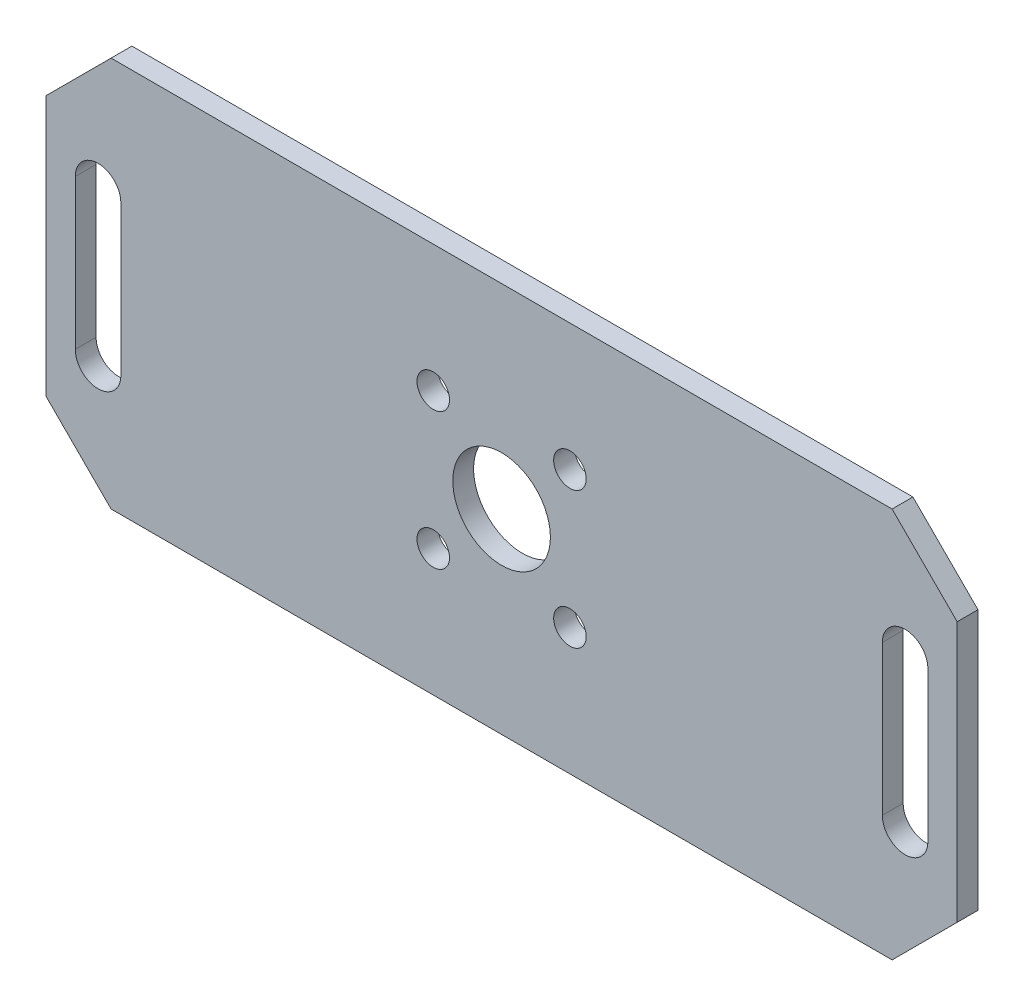
ISO-10303-21;
HEADER;
FILE_DESCRIPTION(('STEP AP214'),'2;1');
FILE_NAME('part.step','',(''),(''),'','','');
FILE_SCHEMA(('AUTOMOTIVE_DESIGN { 1 0 10303 214 1 1 1 1 }'));
ENDSEC;
DATA;
#1=APPLICATION_CONTEXT('core data for automotive mechanical design processes');
#2=APPLICATION_PROTOCOL_DEFINITION('international standard','automotive_design',2000,#1);
#3=PRODUCT_CONTEXT('',#1,'mechanical');
#4=PRODUCT('Part','Part','',(#3));
#5=PRODUCT_RELATED_PRODUCT_CATEGORY('part','',(#4));
#6=PRODUCT_DEFINITION_FORMATION('','',#4);
#7=PRODUCT_DEFINITION_CONTEXT('part definition',#1,'design');
#8=PRODUCT_DEFINITION('design','',#6,#7);
#9=PRODUCT_DEFINITION_SHAPE('','',#8);
#10=(LENGTH_UNIT() NAMED_UNIT(*) SI_UNIT(.MILLI.,.METRE.));
#11=(NAMED_UNIT(*) PLANE_ANGLE_UNIT() SI_UNIT($,.RADIAN.));
#12=(NAMED_UNIT(*) SI_UNIT($,.STERADIAN.) SOLID_ANGLE_UNIT());
#13=UNCERTAINTY_MEASURE_WITH_UNIT(LENGTH_MEASURE(1.E-05),#10,'distance_accuracy_value','');
#14=(GEOMETRIC_REPRESENTATION_CONTEXT(3) GLOBAL_UNCERTAINTY_ASSIGNED_CONTEXT((#13)) GLOBAL_UNIT_ASSIGNED_CONTEXT((#10,
#11,#12)) REPRESENTATION_CONTEXT('',''));
#15=CARTESIAN_POINT('',(0.,0.,0.));
#16=DIRECTION('',(0.,0.,1.));
#17=DIRECTION('',(1.,0.,0.));
#18=AXIS2_PLACEMENT_3D('',#15,#16,#17);
#19=CARTESIAN_POINT('',(0.,0.,3.2));
#20=DIRECTION('',(0.,0.,-1.));
#21=DIRECTION('',(-1.,0.,0.));
#22=AXIS2_PLACEMENT_3D('',#19,#20,#21);
#23=PLANE('',#22);
#24=CARTESIAN_POINT('',(10.5,-10.5,3.2));
#25=DIRECTION('',(0.,0.,1.));
#26=DIRECTION('',(1.,0.,0.));
#27=AXIS2_PLACEMENT_3D('',#24,#25,#26);
#28=CIRCLE('',#27,2.5);
#29=CARTESIAN_POINT('',(13.,-10.5,3.2));
#30=VERTEX_POINT('',#29);
#31=EDGE_CURVE('E530',#30,#30,#28,.T.);
#32=ORIENTED_EDGE('',*,*,#31,.F.);
#33=EDGE_LOOP('',(#32));
#34=FACE_BOUND('',#33,.T.);
#35=CARTESIAN_POINT('',(-10.5,10.5,3.2));
#36=DIRECTION('',(0.,0.,1.));
#37=DIRECTION('',(1.,0.,0.));
#38=AXIS2_PLACEMENT_3D('',#35,#36,#37);
#39=CIRCLE('',#38,2.5);
#40=CARTESIAN_POINT('',(-8.,10.5,3.2));
#41=VERTEX_POINT('',#40);
#42=EDGE_CURVE('E542',#41,#41,#39,.T.);
#43=ORIENTED_EDGE('',*,*,#42,.F.);
#44=EDGE_LOOP('',(#43));
#45=FACE_BOUND('',#44,.T.);
#46=CARTESIAN_POINT('',(62.,-11.5,3.2));
#47=DIRECTION('',(0.,0.,1.));
#48=DIRECTION('',(1.,0.,0.));
#49=AXIS2_PLACEMENT_3D('',#46,#47,#48);
#50=CIRCLE('',#49,3.5);
#51=CARTESIAN_POINT('',(58.5,-11.5,3.2));
#52=VERTEX_POINT('',#51);
#53=CARTESIAN_POINT('',(65.5,-11.5,3.2));
#54=VERTEX_POINT('',#53);
#55=EDGE_CURVE('E152',#52,#54,#50,.T.);
#56=ORIENTED_EDGE('',*,*,#55,.F.);
#57=DIRECTION('',(0.,-1.,0.));
#58=VECTOR('',#57,1.);
#59=CARTESIAN_POINT('',(58.5,-11.5,3.2));
#60=LINE('',#59,#58);
#61=CARTESIAN_POINT('',(58.5,11.5,3.2));
#62=VERTEX_POINT('',#61);
#63=EDGE_CURVE('E177',#62,#52,#60,.T.);
#64=ORIENTED_EDGE('',*,*,#63,.F.);
#65=CARTESIAN_POINT('',(62.,11.5,3.2));
#66=DIRECTION('',(0.,0.,1.));
#67=DIRECTION('',(1.,0.,0.));
#68=AXIS2_PLACEMENT_3D('',#65,#66,#67);
#69=CIRCLE('',#68,3.5);
#70=CARTESIAN_POINT('',(65.5,11.5,3.2));
#71=VERTEX_POINT('',#70);
#72=EDGE_CURVE('E175',#71,#62,#69,.T.);
#73=ORIENTED_EDGE('',*,*,#72,.F.);
#74=DIRECTION('',(0.,1.,0.));
#75=VECTOR('',#74,1.);
#76=CARTESIAN_POINT('',(65.5,-11.5,3.2));
#77=LINE('',#76,#75);
#78=EDGE_CURVE('E162',#54,#71,#77,.T.);
#79=ORIENTED_EDGE('',*,*,#78,.F.);
#80=EDGE_LOOP('',(#56,#64,#73,#79));
#81=FACE_BOUND('',#80,.T.);
#82=DIRECTION('',(0.,-1.,0.));
#83=VECTOR('',#82,1.);
#84=CARTESIAN_POINT('',(-70.,-30.,3.2));
#85=LINE('',#84,#83);
#86=CARTESIAN_POINT('',(-70.,20.,3.2));
#87=VERTEX_POINT('',#86);
#88=CARTESIAN_POINT('',(-70.,-20.,3.2));
#89=VERTEX_POINT('',#88);
#90=EDGE_CURVE('E231',#87,#89,#85,.T.);
#91=ORIENTED_EDGE('',*,*,#90,.T.);
#92=DIRECTION('',(-0.707106781186546,0.70710678118655,0.));
#93=VECTOR('',#92,1.);
#94=CARTESIAN_POINT('',(-60.0000000000001,-30.,3.2));
#95=LINE('',#94,#93);
#96=CARTESIAN_POINT('',(-60.0000000000001,-30.,3.2));
#97=VERTEX_POINT('',#96);
#98=EDGE_CURVE('E269',#89,#97,#95,.F.);
#99=ORIENTED_EDGE('',*,*,#98,.T.);
#100=DIRECTION('',(1.,0.,0.));
#101=VECTOR('',#100,1.);
#102=CARTESIAN_POINT('',(-70.,-30.,3.2));
#103=LINE('',#102,#101);
#104=CARTESIAN_POINT('',(60.,-30.,3.2));
#105=VERTEX_POINT('',#104);
#106=EDGE_CURVE('E234',#97,#105,#103,.T.);
#107=ORIENTED_EDGE('',*,*,#106,.T.);
#108=DIRECTION('',(-0.707106781186549,-0.707106781186546,0.));
#109=VECTOR('',#108,1.);
#110=CARTESIAN_POINT('',(70.,-20.,3.2));
#111=LINE('',#110,#109);
#112=CARTESIAN_POINT('',(70.,-20.,3.2));
#113=VERTEX_POINT('',#112);
#114=EDGE_CURVE('E267',#105,#113,#111,.F.);
#115=ORIENTED_EDGE('',*,*,#114,.T.);
#116=DIRECTION('',(0.,1.,0.));
#117=VECTOR('',#116,1.);
#118=CARTESIAN_POINT('',(70.,-30.,3.2));
#119=LINE('',#118,#117);
#120=CARTESIAN_POINT('',(70.,20.,3.2));
#121=VERTEX_POINT('',#120);
#122=EDGE_CURVE('E226',#113,#121,#119,.T.);
#123=ORIENTED_EDGE('',*,*,#122,.T.);
#124=DIRECTION('',(0.707106781186546,-0.70710678118655,0.));
#125=VECTOR('',#124,1.);
#126=CARTESIAN_POINT('',(60.,30.,3.2));
#127=LINE('',#126,#125);
#128=CARTESIAN_POINT('',(60.,30.,3.2));
#129=VERTEX_POINT('',#128);
#130=EDGE_CURVE('E58',#121,#129,#127,.F.);
#131=ORIENTED_EDGE('',*,*,#130,.T.);
#132=DIRECTION('',(-1.,0.,0.));
#133=VECTOR('',#132,1.);
#134=CARTESIAN_POINT('',(-70.,30.,3.2));
#135=LINE('',#134,#133);
#136=CARTESIAN_POINT('',(-60.,30.,3.2));
#137=VERTEX_POINT('',#136);
#138=EDGE_CURVE('E228',#129,#137,#135,.T.);
#139=ORIENTED_EDGE('',*,*,#138,.T.);
#140=DIRECTION('',(0.707106781186549,0.707106781186546,0.));
#141=VECTOR('',#140,1.);
#142=CARTESIAN_POINT('',(-70.,20.,3.2));
#143=LINE('',#142,#141);
#144=EDGE_CURVE('E264',#137,#87,#143,.F.);
#145=ORIENTED_EDGE('',*,*,#144,.T.);
#146=EDGE_LOOP('',(#91,#99,#107,#115,#123,#131,#139,#145));
#147=FACE_BOUND('',#146,.T.);
#148=CARTESIAN_POINT('',(-62.,-11.4999999999999,3.2));
#149=DIRECTION('',(0.,0.,1.));
#150=DIRECTION('',(1.,0.,0.));
#151=AXIS2_PLACEMENT_3D('',#148,#149,#150);
#152=CIRCLE('',#151,3.5);
#153=CARTESIAN_POINT('',(-65.5,-11.4999999999999,3.2));
#154=VERTEX_POINT('',#153);
#155=CARTESIAN_POINT('',(-58.5,-11.4999999999999,3.2));
#156=VERTEX_POINT('',#155);
#157=EDGE_CURVE('E195',#154,#156,#152,.T.);
#158=ORIENTED_EDGE('',*,*,#157,.F.);
#159=DIRECTION('',(0.,-1.,0.));
#160=VECTOR('',#159,1.);
#161=CARTESIAN_POINT('',(-65.5,-11.4999999999999,3.2));
#162=LINE('',#161,#160);
#163=CARTESIAN_POINT('',(-65.5,11.4999999999999,3.2));
#164=VERTEX_POINT('',#163);
#165=EDGE_CURVE('E203',#164,#154,#162,.T.);
#166=ORIENTED_EDGE('',*,*,#165,.F.);
#167=CARTESIAN_POINT('',(-62.,11.4999999999999,3.2));
#168=DIRECTION('',(0.,0.,1.));
#169=DIRECTION('',(1.,0.,0.));
#170=AXIS2_PLACEMENT_3D('',#167,#168,#169);
#171=CIRCLE('',#170,3.5);
#172=CARTESIAN_POINT('',(-58.5,11.5000000000001,3.2));
#173=VERTEX_POINT('',#172);
#174=EDGE_CURVE('E200',#173,#164,#171,.T.);
#175=ORIENTED_EDGE('',*,*,#174,.F.);
#176=DIRECTION('',(0.,1.,0.));
#177=VECTOR('',#176,1.);
#178=CARTESIAN_POINT('',(-58.5,-11.4999999999999,3.2));
#179=LINE('',#178,#177);
#180=EDGE_CURVE('E197',#156,#173,#179,.T.);
#181=ORIENTED_EDGE('',*,*,#180,.F.);
#182=EDGE_LOOP('',(#158,#166,#175,#181));
#183=FACE_BOUND('',#182,.T.);
#184=CARTESIAN_POINT('',(0.,0.,3.2));
#185=DIRECTION('',(0.,0.,1.));
#186=DIRECTION('',(1.,0.,0.));
#187=AXIS2_PLACEMENT_3D('',#184,#185,#186);
#188=CIRCLE('',#187,7.5);
#189=CARTESIAN_POINT('',(7.49999999999998,0.,3.2));
#190=VERTEX_POINT('',#189);
#191=EDGE_CURVE('E184',#190,#190,#188,.T.);
#192=ORIENTED_EDGE('',*,*,#191,.F.);
#193=EDGE_LOOP('',(#192));
#194=FACE_BOUND('',#193,.T.);
#195=CARTESIAN_POINT('',(10.5,10.5,3.2));
#196=DIRECTION('',(0.,0.,1.));
#197=DIRECTION('',(1.,0.,0.));
#198=AXIS2_PLACEMENT_3D('',#195,#196,#197);
#199=CIRCLE('',#198,2.5);
#200=CARTESIAN_POINT('',(13.,10.5,3.2));
#201=VERTEX_POINT('',#200);
#202=EDGE_CURVE('E536',#201,#201,#199,.T.);
#203=ORIENTED_EDGE('',*,*,#202,.F.);
#204=EDGE_LOOP('',(#203));
#205=FACE_BOUND('',#204,.T.);
#206=CARTESIAN_POINT('',(-10.5,-10.5,3.2));
#207=DIRECTION('',(0.,0.,1.));
#208=DIRECTION('',(1.,0.,0.));
#209=AXIS2_PLACEMENT_3D('',#206,#207,#208);
#210=CIRCLE('',#209,2.5);
#211=CARTESIAN_POINT('',(-8.,-10.5,3.2));
#212=VERTEX_POINT('',#211);
#213=EDGE_CURVE('E521',#212,#212,#210,.T.);
#214=ORIENTED_EDGE('',*,*,#213,.F.);
#215=EDGE_LOOP('',(#214));
#216=FACE_BOUND('',#215,.T.);
#217=ADVANCED_FACE('F37',(#34,#45,#81,#147,#183,#194,#205,#216),#23,.F.);
#218=CARTESIAN_POINT('',(0.,0.,0.));
#219=DIRECTION('',(0.,0.,-1.));
#220=DIRECTION('',(-1.,0.,0.));
#221=AXIS2_PLACEMENT_3D('',#218,#219,#220);
#222=PLANE('',#221);
#223=CARTESIAN_POINT('',(10.5,-10.5,0.));
#224=DIRECTION('',(0.,0.,1.));
#225=DIRECTION('',(1.,0.,0.));
#226=AXIS2_PLACEMENT_3D('',#223,#224,#225);
#227=CIRCLE('',#226,2.5);
#228=CARTESIAN_POINT('',(13.,-10.5,0.));
#229=VERTEX_POINT('',#228);
#230=EDGE_CURVE('E527',#229,#229,#227,.T.);
#231=ORIENTED_EDGE('',*,*,#230,.T.);
#232=EDGE_LOOP('',(#231));
#233=FACE_BOUND('',#232,.T.);
#234=CARTESIAN_POINT('',(-10.5,10.5,0.));
#235=DIRECTION('',(0.,0.,1.));
#236=DIRECTION('',(1.,0.,0.));
#237=AXIS2_PLACEMENT_3D('',#234,#235,#236);
#238=CIRCLE('',#237,2.5);
#239=CARTESIAN_POINT('',(-8.,10.5,0.));
#240=VERTEX_POINT('',#239);
#241=EDGE_CURVE('E539',#240,#240,#238,.T.);
#242=ORIENTED_EDGE('',*,*,#241,.T.);
#243=EDGE_LOOP('',(#242));
#244=FACE_BOUND('',#243,.T.);
#245=DIRECTION('',(0.,-1.,0.));
#246=VECTOR('',#245,1.);
#247=CARTESIAN_POINT('',(58.5,-11.5,0.));
#248=LINE('',#247,#246);
#249=CARTESIAN_POINT('',(58.5,11.5,0.));
#250=VERTEX_POINT('',#249);
#251=CARTESIAN_POINT('',(58.5,-11.5,0.));
#252=VERTEX_POINT('',#251);
#253=EDGE_CURVE('E163',#250,#252,#248,.T.);
#254=ORIENTED_EDGE('',*,*,#253,.T.);
#255=CARTESIAN_POINT('',(62.,-11.5,0.));
#256=DIRECTION('',(0.,0.,1.));
#257=DIRECTION('',(1.,0.,0.));
#258=AXIS2_PLACEMENT_3D('',#255,#256,#257);
#259=CIRCLE('',#258,3.5);
#260=CARTESIAN_POINT('',(65.5,-11.5,0.));
#261=VERTEX_POINT('',#260);
#262=EDGE_CURVE('E182',#252,#261,#259,.T.);
#263=ORIENTED_EDGE('',*,*,#262,.T.);
#264=DIRECTION('',(0.,1.,0.));
#265=VECTOR('',#264,1.);
#266=CARTESIAN_POINT('',(65.5,-11.5,0.));
#267=LINE('',#266,#265);
#268=CARTESIAN_POINT('',(65.5,11.5,0.));
#269=VERTEX_POINT('',#268);
#270=EDGE_CURVE('E169',#261,#269,#267,.T.);
#271=ORIENTED_EDGE('',*,*,#270,.T.);
#272=CARTESIAN_POINT('',(62.,11.5,0.));
#273=DIRECTION('',(0.,0.,1.));
#274=DIRECTION('',(1.,0.,0.));
#275=AXIS2_PLACEMENT_3D('',#272,#273,#274);
#276=CIRCLE('',#275,3.5);
#277=EDGE_CURVE('E186',#269,#250,#276,.T.);
#278=ORIENTED_EDGE('',*,*,#277,.T.);
#279=EDGE_LOOP('',(#254,#263,#271,#278));
#280=FACE_BOUND('',#279,.T.);
#281=DIRECTION('',(1.,0.,0.));
#282=VECTOR('',#281,1.);
#283=CARTESIAN_POINT('',(-70.,-30.,0.));
#284=LINE('',#283,#282);
#285=CARTESIAN_POINT('',(-60.0000000000001,-30.,0.));
#286=VERTEX_POINT('',#285);
#287=CARTESIAN_POINT('',(59.9999999999999,-30.,0.));
#288=VERTEX_POINT('',#287);
#289=EDGE_CURVE('E229',#286,#288,#284,.T.);
#290=ORIENTED_EDGE('',*,*,#289,.F.);
#291=DIRECTION('',(0.707106781186546,-0.70710678118655,0.));
#292=VECTOR('',#291,1.);
#293=CARTESIAN_POINT('',(-45.0000000000002,-44.9999999999999,0.));
#294=LINE('',#293,#292);
#295=CARTESIAN_POINT('',(-70.,-20.,0.));
#296=VERTEX_POINT('',#295);
#297=EDGE_CURVE('E257',#286,#296,#294,.F.);
#298=ORIENTED_EDGE('',*,*,#297,.T.);
#299=DIRECTION('',(0.,-1.,0.));
#300=VECTOR('',#299,1.);
#301=CARTESIAN_POINT('',(-70.,-30.,0.));
#302=LINE('',#301,#300);
#303=CARTESIAN_POINT('',(-70.,20.,0.));
#304=VERTEX_POINT('',#303);
#305=EDGE_CURVE('E242',#304,#296,#302,.T.);
#306=ORIENTED_EDGE('',*,*,#305,.F.);
#307=DIRECTION('',(-0.707106781186549,-0.707106781186546,0.));
#308=VECTOR('',#307,1.);
#309=CARTESIAN_POINT('',(-44.9999999999998,45.0000000000001,0.));
#310=LINE('',#309,#308);
#311=CARTESIAN_POINT('',(-60.,30.,0.));
#312=VERTEX_POINT('',#311);
#313=EDGE_CURVE('E251',#304,#312,#310,.F.);
#314=ORIENTED_EDGE('',*,*,#313,.T.);
#315=DIRECTION('',(-1.,0.,0.));
#316=VECTOR('',#315,1.);
#317=CARTESIAN_POINT('',(-70.,30.,0.));
#318=LINE('',#317,#316);
#319=CARTESIAN_POINT('',(60.,30.,0.));
#320=VERTEX_POINT('',#319);
#321=EDGE_CURVE('E240',#320,#312,#318,.T.);
#322=ORIENTED_EDGE('',*,*,#321,.F.);
#323=DIRECTION('',(-0.707106781186546,0.70710678118655,0.));
#324=VECTOR('',#323,1.);
#325=CARTESIAN_POINT('',(45.0000000000002,44.9999999999999,0.));
#326=LINE('',#325,#324);
#327=CARTESIAN_POINT('',(70.,20.,0.));
#328=VERTEX_POINT('',#327);
#329=EDGE_CURVE('E253',#320,#328,#326,.F.);
#330=ORIENTED_EDGE('',*,*,#329,.T.);
#331=DIRECTION('',(0.,1.,0.));
#332=VECTOR('',#331,1.);
#333=CARTESIAN_POINT('',(70.,-30.,0.));
#334=LINE('',#333,#332);
#335=CARTESIAN_POINT('',(70.,-20.,0.));
#336=VERTEX_POINT('',#335);
#337=EDGE_CURVE('E225',#336,#328,#334,.T.);
#338=ORIENTED_EDGE('',*,*,#337,.F.);
#339=DIRECTION('',(0.707106781186549,0.707106781186546,0.));
#340=VECTOR('',#339,1.);
#341=CARTESIAN_POINT('',(44.9999999999998,-45.,0.));
#342=LINE('',#341,#340);
#343=EDGE_CURVE('E255',#336,#288,#342,.F.);
#344=ORIENTED_EDGE('',*,*,#343,.T.);
#345=EDGE_LOOP('',(#290,#298,#306,#314,#322,#330,#338,#344));
#346=FACE_BOUND('',#345,.T.);
#347=DIRECTION('',(0.,-1.,0.));
#348=VECTOR('',#347,1.);
#349=CARTESIAN_POINT('',(-65.5,-11.4999999999999,0.));
#350=LINE('',#349,#348);
#351=CARTESIAN_POINT('',(-65.5,11.4999999999999,0.));
#352=VERTEX_POINT('',#351);
#353=CARTESIAN_POINT('',(-65.5,-11.4999999999999,0.));
#354=VERTEX_POINT('',#353);
#355=EDGE_CURVE('E198',#352,#354,#350,.T.);
#356=ORIENTED_EDGE('',*,*,#355,.T.);
#357=CARTESIAN_POINT('',(-62.,-11.4999999999999,0.));
#358=DIRECTION('',(0.,0.,1.));
#359=DIRECTION('',(1.,0.,0.));
#360=AXIS2_PLACEMENT_3D('',#357,#358,#359);
#361=CIRCLE('',#360,3.5);
#362=CARTESIAN_POINT('',(-58.5,-11.4999999999999,0.));
#363=VERTEX_POINT('',#362);
#364=EDGE_CURVE('E170',#354,#363,#361,.T.);
#365=ORIENTED_EDGE('',*,*,#364,.T.);
#366=DIRECTION('',(0.,1.,0.));
#367=VECTOR('',#366,1.);
#368=CARTESIAN_POINT('',(-58.5,-11.4999999999999,0.));
#369=LINE('',#368,#367);
#370=CARTESIAN_POINT('',(-58.5,11.5000000000001,0.));
#371=VERTEX_POINT('',#370);
#372=EDGE_CURVE('E208',#363,#371,#369,.T.);
#373=ORIENTED_EDGE('',*,*,#372,.T.);
#374=CARTESIAN_POINT('',(-62.,11.4999999999999,0.));
#375=DIRECTION('',(0.,0.,1.));
#376=DIRECTION('',(1.,0.,0.));
#377=AXIS2_PLACEMENT_3D('',#374,#375,#376);
#378=CIRCLE('',#377,3.5);
#379=EDGE_CURVE('E211',#371,#352,#378,.T.);
#380=ORIENTED_EDGE('',*,*,#379,.T.);
#381=EDGE_LOOP('',(#356,#365,#373,#380));
#382=FACE_BOUND('',#381,.T.);
#383=CARTESIAN_POINT('',(0.,0.,0.));
#384=DIRECTION('',(0.,0.,1.));
#385=DIRECTION('',(1.,0.,0.));
#386=AXIS2_PLACEMENT_3D('',#383,#384,#385);
#387=CIRCLE('',#386,7.5);
#388=CARTESIAN_POINT('',(7.49999999999998,0.,0.));
#389=VERTEX_POINT('',#388);
#390=EDGE_CURVE('E545',#389,#389,#387,.T.);
#391=ORIENTED_EDGE('',*,*,#390,.T.);
#392=EDGE_LOOP('',(#391));
#393=FACE_BOUND('',#392,.T.);
#394=CARTESIAN_POINT('',(10.5,10.5,0.));
#395=DIRECTION('',(0.,0.,1.));
#396=DIRECTION('',(1.,0.,0.));
#397=AXIS2_PLACEMENT_3D('',#394,#395,#396);
#398=CIRCLE('',#397,2.5);
#399=CARTESIAN_POINT('',(13.,10.5,0.));
#400=VERTEX_POINT('',#399);
#401=EDGE_CURVE('E533',#400,#400,#398,.T.);
#402=ORIENTED_EDGE('',*,*,#401,.T.);
#403=EDGE_LOOP('',(#402));
#404=FACE_BOUND('',#403,.T.);
#405=CARTESIAN_POINT('',(-10.5,-10.5,0.));
#406=DIRECTION('',(0.,0.,1.));
#407=DIRECTION('',(1.,0.,0.));
#408=AXIS2_PLACEMENT_3D('',#405,#406,#407);
#409=CIRCLE('',#408,2.5);
#410=CARTESIAN_POINT('',(-8.,-10.5,0.));
#411=VERTEX_POINT('',#410);
#412=EDGE_CURVE('E524',#411,#411,#409,.T.);
#413=ORIENTED_EDGE('',*,*,#412,.T.);
#414=EDGE_LOOP('',(#413));
#415=FACE_BOUND('',#414,.T.);
#416=ADVANCED_FACE('F285',(#233,#244,#280,#346,#382,#393,#404,#415),#222,.T.);
#417=CARTESIAN_POINT('',(70.,-30.,3.2));
#418=DIRECTION('',(-1.,0.,0.));
#419=DIRECTION('',(0.,0.,1.));
#420=AXIS2_PLACEMENT_3D('',#417,#418,#419);
#421=PLANE('',#420);
#422=ORIENTED_EDGE('',*,*,#122,.F.);
#423=DIRECTION('',(0.,0.,-1.));
#424=VECTOR('',#423,1.);
#425=CARTESIAN_POINT('',(70.,-20.,3.2));
#426=LINE('',#425,#424);
#427=EDGE_CURVE('E273',#113,#336,#426,.T.);
#428=ORIENTED_EDGE('',*,*,#427,.T.);
#429=ORIENTED_EDGE('',*,*,#337,.T.);
#430=DIRECTION('',(0.,0.,1.));
#431=VECTOR('',#430,1.);
#432=CARTESIAN_POINT('',(70.,20.,3.2));
#433=LINE('',#432,#431);
#434=EDGE_CURVE('E271',#328,#121,#433,.T.);
#435=ORIENTED_EDGE('',*,*,#434,.T.);
#436=EDGE_LOOP('',(#422,#428,#429,#435));
#437=FACE_BOUND('',#436,.T.);
#438=ADVANCED_FACE('F279',(#437),#421,.F.);
#439=CARTESIAN_POINT('',(-70.,30.,3.2));
#440=DIRECTION('',(0.,-1.,0.));
#441=DIRECTION('',(0.,0.,-1.));
#442=AXIS2_PLACEMENT_3D('',#439,#440,#441);
#443=PLANE('',#442);
#444=ORIENTED_EDGE('',*,*,#138,.F.);
#445=DIRECTION('',(0.,0.,-1.));
#446=VECTOR('',#445,1.);
#447=CARTESIAN_POINT('',(60.,30.,3.2));
#448=LINE('',#447,#446);
#449=EDGE_CURVE('E11',#129,#320,#448,.T.);
#450=ORIENTED_EDGE('',*,*,#449,.T.);
#451=ORIENTED_EDGE('',*,*,#321,.T.);
#452=DIRECTION('',(0.,0.,1.));
#453=VECTOR('',#452,1.);
#454=CARTESIAN_POINT('',(-60.,30.,3.2));
#455=LINE('',#454,#453);
#456=EDGE_CURVE('E45',#312,#137,#455,.T.);
#457=ORIENTED_EDGE('',*,*,#456,.T.);
#458=EDGE_LOOP('',(#444,#450,#451,#457));
#459=FACE_BOUND('',#458,.T.);
#460=ADVANCED_FACE('F291',(#459),#443,.F.);
#461=CARTESIAN_POINT('',(-70.,-30.,3.2));
#462=DIRECTION('',(1.,0.,0.));
#463=DIRECTION('',(0.,0.,-1.));
#464=AXIS2_PLACEMENT_3D('',#461,#462,#463);
#465=PLANE('',#464);
#466=ORIENTED_EDGE('',*,*,#305,.T.);
#467=DIRECTION('',(0.,0.,1.));
#468=VECTOR('',#467,1.);
#469=CARTESIAN_POINT('',(-70.,-20.,3.2));
#470=LINE('',#469,#468);
#471=EDGE_CURVE('E262',#296,#89,#470,.T.);
#472=ORIENTED_EDGE('',*,*,#471,.T.);
#473=ORIENTED_EDGE('',*,*,#90,.F.);
#474=DIRECTION('',(0.,0.,-1.));
#475=VECTOR('',#474,1.);
#476=CARTESIAN_POINT('',(-70.,20.,3.2));
#477=LINE('',#476,#475);
#478=EDGE_CURVE('E259',#87,#304,#477,.T.);
#479=ORIENTED_EDGE('',*,*,#478,.T.);
#480=EDGE_LOOP('',(#466,#472,#473,#479));
#481=FACE_BOUND('',#480,.T.);
#482=ADVANCED_FACE('F299',(#481),#465,.F.);
#483=CARTESIAN_POINT('',(-70.,-30.,3.2));
#484=DIRECTION('',(0.,1.,0.));
#485=DIRECTION('',(0.,0.,1.));
#486=AXIS2_PLACEMENT_3D('',#483,#484,#485);
#487=PLANE('',#486);
#488=ORIENTED_EDGE('',*,*,#106,.F.);
#489=DIRECTION('',(0.,0.,-1.));
#490=VECTOR('',#489,1.);
#491=CARTESIAN_POINT('',(-60.0000000000001,-30.,3.2));
#492=LINE('',#491,#490);
#493=EDGE_CURVE('E248',#97,#286,#492,.T.);
#494=ORIENTED_EDGE('',*,*,#493,.T.);
#495=ORIENTED_EDGE('',*,*,#289,.T.);
#496=DIRECTION('',(0.,0.,1.));
#497=VECTOR('',#496,1.);
#498=CARTESIAN_POINT('',(59.9999999999999,-30.,3.2));
#499=LINE('',#498,#497);
#500=EDGE_CURVE('E237',#288,#105,#499,.T.);
#501=ORIENTED_EDGE('',*,*,#500,.T.);
#502=EDGE_LOOP('',(#488,#494,#495,#501));
#503=FACE_BOUND('',#502,.T.);
#504=ADVANCED_FACE('F307',(#503),#487,.F.);
#505=CARTESIAN_POINT('',(-62.,-11.4999999999999,3.2));
#506=DIRECTION('',(0.,0.,-1.));
#507=DIRECTION('',(-1.,0.,0.));
#508=AXIS2_PLACEMENT_3D('',#505,#506,#507);
#509=CYLINDRICAL_SURFACE('',#508,3.5);
#510=ORIENTED_EDGE('',*,*,#364,.F.);
#511=DIRECTION('',(0.,0.,-1.));
#512=VECTOR('',#511,1.);
#513=CARTESIAN_POINT('',(-65.5,-11.4999999999999,3.2));
#514=LINE('',#513,#512);
#515=EDGE_CURVE('E205',#154,#354,#514,.T.);
#516=ORIENTED_EDGE('',*,*,#515,.F.);
#517=ORIENTED_EDGE('',*,*,#157,.T.);
#518=DIRECTION('',(0.,0.,-1.));
#519=VECTOR('',#518,1.);
#520=CARTESIAN_POINT('',(-58.5,-11.4999999999999,3.2));
#521=LINE('',#520,#519);
#522=EDGE_CURVE('E222',#156,#363,#521,.T.);
#523=ORIENTED_EDGE('',*,*,#522,.T.);
#524=EDGE_LOOP('',(#510,#516,#517,#523));
#525=FACE_BOUND('',#524,.T.);
#526=ADVANCED_FACE('F329',(#525),#509,.F.);
#527=CARTESIAN_POINT('',(-58.5,-11.4999999999999,3.2));
#528=DIRECTION('',(-1.,0.,0.));
#529=DIRECTION('',(0.,0.,1.));
#530=AXIS2_PLACEMENT_3D('',#527,#528,#529);
#531=PLANE('',#530);
#532=ORIENTED_EDGE('',*,*,#372,.F.);
#533=ORIENTED_EDGE('',*,*,#522,.F.);
#534=ORIENTED_EDGE('',*,*,#180,.T.);
#535=DIRECTION('',(0.,0.,-1.));
#536=VECTOR('',#535,1.);
#537=CARTESIAN_POINT('',(-58.5,11.5000000000001,3.2));
#538=LINE('',#537,#536);
#539=EDGE_CURVE('E220',#173,#371,#538,.T.);
#540=ORIENTED_EDGE('',*,*,#539,.T.);
#541=EDGE_LOOP('',(#532,#533,#534,#540));
#542=FACE_BOUND('',#541,.T.);
#543=ADVANCED_FACE('F362',(#542),#531,.T.);
#544=CARTESIAN_POINT('',(-62.,11.4999999999999,3.2));
#545=DIRECTION('',(0.,0.,-1.));
#546=DIRECTION('',(-1.,0.,0.));
#547=AXIS2_PLACEMENT_3D('',#544,#545,#546);
#548=CYLINDRICAL_SURFACE('',#547,3.5);
#549=ORIENTED_EDGE('',*,*,#379,.F.);
#550=ORIENTED_EDGE('',*,*,#539,.F.);
#551=ORIENTED_EDGE('',*,*,#174,.T.);
#552=DIRECTION('',(0.,0.,-1.));
#553=VECTOR('',#552,1.);
#554=CARTESIAN_POINT('',(-65.5,11.4999999999999,3.2));
#555=LINE('',#554,#553);
#556=EDGE_CURVE('E218',#164,#352,#555,.T.);
#557=ORIENTED_EDGE('',*,*,#556,.T.);
#558=EDGE_LOOP('',(#549,#550,#551,#557));
#559=FACE_BOUND('',#558,.T.);
#560=ADVANCED_FACE('F369',(#559),#548,.F.);
#561=CARTESIAN_POINT('',(-65.5,-11.4999999999999,3.2));
#562=DIRECTION('',(1.,0.,0.));
#563=DIRECTION('',(0.,0.,-1.));
#564=AXIS2_PLACEMENT_3D('',#561,#562,#563);
#565=PLANE('',#564);
#566=ORIENTED_EDGE('',*,*,#355,.F.);
#567=ORIENTED_EDGE('',*,*,#556,.F.);
#568=ORIENTED_EDGE('',*,*,#165,.T.);
#569=ORIENTED_EDGE('',*,*,#515,.T.);
#570=EDGE_LOOP('',(#566,#567,#568,#569));
#571=FACE_BOUND('',#570,.T.);
#572=ADVANCED_FACE('F376',(#571),#565,.T.);
#573=CARTESIAN_POINT('',(62.,-11.5,3.2));
#574=DIRECTION('',(0.,0.,-1.));
#575=DIRECTION('',(-1.,0.,0.));
#576=AXIS2_PLACEMENT_3D('',#573,#574,#575);
#577=CYLINDRICAL_SURFACE('',#576,3.5);
#578=ORIENTED_EDGE('',*,*,#262,.F.);
#579=DIRECTION('',(0.,0.,-1.));
#580=VECTOR('',#579,1.);
#581=CARTESIAN_POINT('',(58.5,-11.5,3.2));
#582=LINE('',#581,#580);
#583=EDGE_CURVE('E158',#52,#252,#582,.T.);
#584=ORIENTED_EDGE('',*,*,#583,.F.);
#585=ORIENTED_EDGE('',*,*,#55,.T.);
#586=DIRECTION('',(0.,0.,-1.));
#587=VECTOR('',#586,1.);
#588=CARTESIAN_POINT('',(65.5,-11.5,3.2));
#589=LINE('',#588,#587);
#590=EDGE_CURVE('E155',#54,#261,#589,.T.);
#591=ORIENTED_EDGE('',*,*,#590,.T.);
#592=EDGE_LOOP('',(#578,#584,#585,#591));
#593=FACE_BOUND('',#592,.T.);
#594=ADVANCED_FACE('F154',(#593),#577,.F.);
#595=CARTESIAN_POINT('',(65.5,-11.5,3.2));
#596=DIRECTION('',(-1.,0.,0.));
#597=DIRECTION('',(0.,0.,1.));
#598=AXIS2_PLACEMENT_3D('',#595,#596,#597);
#599=PLANE('',#598);
#600=ORIENTED_EDGE('',*,*,#270,.F.);
#601=ORIENTED_EDGE('',*,*,#590,.F.);
#602=ORIENTED_EDGE('',*,*,#78,.T.);
#603=DIRECTION('',(0.,0.,-1.));
#604=VECTOR('',#603,1.);
#605=CARTESIAN_POINT('',(65.5,11.5,3.2));
#606=LINE('',#605,#604);
#607=EDGE_CURVE('E171',#71,#269,#606,.T.);
#608=ORIENTED_EDGE('',*,*,#607,.T.);
#609=EDGE_LOOP('',(#600,#601,#602,#608));
#610=FACE_BOUND('',#609,.T.);
#611=ADVANCED_FACE('F166',(#610),#599,.T.);
#612=CARTESIAN_POINT('',(62.,11.5,3.2));
#613=DIRECTION('',(0.,0.,-1.));
#614=DIRECTION('',(-1.,0.,0.));
#615=AXIS2_PLACEMENT_3D('',#612,#613,#614);
#616=CYLINDRICAL_SURFACE('',#615,3.5);
#617=ORIENTED_EDGE('',*,*,#277,.F.);
#618=ORIENTED_EDGE('',*,*,#607,.F.);
#619=ORIENTED_EDGE('',*,*,#72,.T.);
#620=DIRECTION('',(0.,0.,-1.));
#621=VECTOR('',#620,1.);
#622=CARTESIAN_POINT('',(58.5,11.5,3.2));
#623=LINE('',#622,#621);
#624=EDGE_CURVE('E192',#62,#250,#623,.T.);
#625=ORIENTED_EDGE('',*,*,#624,.T.);
#626=EDGE_LOOP('',(#617,#618,#619,#625));
#627=FACE_BOUND('',#626,.T.);
#628=ADVANCED_FACE('F397',(#627),#616,.F.);
#629=CARTESIAN_POINT('',(58.5,-11.5,3.2));
#630=DIRECTION('',(1.,0.,0.));
#631=DIRECTION('',(0.,0.,-1.));
#632=AXIS2_PLACEMENT_3D('',#629,#630,#631);
#633=PLANE('',#632);
#634=ORIENTED_EDGE('',*,*,#253,.F.);
#635=ORIENTED_EDGE('',*,*,#624,.F.);
#636=ORIENTED_EDGE('',*,*,#63,.T.);
#637=ORIENTED_EDGE('',*,*,#583,.T.);
#638=EDGE_LOOP('',(#634,#635,#636,#637));
#639=FACE_BOUND('',#638,.T.);
#640=ADVANCED_FACE('F404',(#639),#633,.T.);
#641=CARTESIAN_POINT('',(0.,0.,3.2));
#642=DIRECTION('',(0.,0.,-1.));
#643=DIRECTION('',(-1.,0.,0.));
#644=AXIS2_PLACEMENT_3D('',#641,#642,#643);
#645=CYLINDRICAL_SURFACE('',#644,7.5);
#646=ORIENTED_EDGE('',*,*,#191,.T.);
#647=EDGE_LOOP('',(#646));
#648=FACE_BOUND('',#647,.T.);
#649=ORIENTED_EDGE('',*,*,#390,.F.);
#650=EDGE_LOOP('',(#649));
#651=FACE_BOUND('',#650,.T.);
#652=ADVANCED_FACE('F412',(#648,#651),#645,.F.);
#653=CARTESIAN_POINT('',(-10.5,10.5,3.2));
#654=DIRECTION('',(0.,0.,-1.));
#655=DIRECTION('',(-1.,0.,0.));
#656=AXIS2_PLACEMENT_3D('',#653,#654,#655);
#657=CYLINDRICAL_SURFACE('',#656,2.5);
#658=ORIENTED_EDGE('',*,*,#42,.T.);
#659=EDGE_LOOP('',(#658));
#660=FACE_BOUND('',#659,.T.);
#661=ORIENTED_EDGE('',*,*,#241,.F.);
#662=EDGE_LOOP('',(#661));
#663=FACE_BOUND('',#662,.T.);
#664=ADVANCED_FACE('F420',(#660,#663),#657,.F.);
#665=CARTESIAN_POINT('',(10.5,10.5,3.2));
#666=DIRECTION('',(0.,0.,-1.));
#667=DIRECTION('',(-1.,0.,0.));
#668=AXIS2_PLACEMENT_3D('',#665,#666,#667);
#669=CYLINDRICAL_SURFACE('',#668,2.5);
#670=ORIENTED_EDGE('',*,*,#202,.T.);
#671=EDGE_LOOP('',(#670));
#672=FACE_BOUND('',#671,.T.);
#673=ORIENTED_EDGE('',*,*,#401,.F.);
#674=EDGE_LOOP('',(#673));
#675=FACE_BOUND('',#674,.T.);
#676=ADVANCED_FACE('F428',(#672,#675),#669,.F.);
#677=CARTESIAN_POINT('',(10.5,-10.5,3.2));
#678=DIRECTION('',(0.,0.,-1.));
#679=DIRECTION('',(-1.,0.,0.));
#680=AXIS2_PLACEMENT_3D('',#677,#678,#679);
#681=CYLINDRICAL_SURFACE('',#680,2.5);
#682=ORIENTED_EDGE('',*,*,#31,.T.);
#683=EDGE_LOOP('',(#682));
#684=FACE_BOUND('',#683,.T.);
#685=ORIENTED_EDGE('',*,*,#230,.F.);
#686=EDGE_LOOP('',(#685));
#687=FACE_BOUND('',#686,.T.);
#688=ADVANCED_FACE('F436',(#684,#687),#681,.F.);
#689=CARTESIAN_POINT('',(-10.5,-10.5,3.2));
#690=DIRECTION('',(0.,0.,-1.));
#691=DIRECTION('',(-1.,0.,0.));
#692=AXIS2_PLACEMENT_3D('',#689,#690,#691);
#693=CYLINDRICAL_SURFACE('',#692,2.5);
#694=ORIENTED_EDGE('',*,*,#213,.T.);
#695=EDGE_LOOP('',(#694));
#696=FACE_BOUND('',#695,.T.);
#697=ORIENTED_EDGE('',*,*,#412,.F.);
#698=EDGE_LOOP('',(#697));
#699=FACE_BOUND('',#698,.T.);
#700=ADVANCED_FACE('F316',(#696,#699),#693,.F.);
#701=CARTESIAN_POINT('',(-60.0000000000001,-30.,3.2));
#702=DIRECTION('',(0.707106781186549,0.707106781186545,0.));
#703=DIRECTION('',(0.,0.,-1.));
#704=AXIS2_PLACEMENT_3D('',#701,#702,#703);
#705=PLANE('',#704);
#706=ORIENTED_EDGE('',*,*,#98,.F.);
#707=ORIENTED_EDGE('',*,*,#471,.F.);
#708=ORIENTED_EDGE('',*,*,#297,.F.);
#709=ORIENTED_EDGE('',*,*,#493,.F.);
#710=EDGE_LOOP('',(#706,#707,#708,#709));
#711=FACE_BOUND('',#710,.T.);
#712=ADVANCED_FACE('F304',(#711),#705,.F.);
#713=CARTESIAN_POINT('',(70.,-20.,3.2));
#714=DIRECTION('',(-0.707106781186546,0.707106781186549,0.));
#715=DIRECTION('',(0.,0.,-1.));
#716=AXIS2_PLACEMENT_3D('',#713,#714,#715);
#717=PLANE('',#716);
#718=ORIENTED_EDGE('',*,*,#114,.F.);
#719=ORIENTED_EDGE('',*,*,#500,.F.);
#720=ORIENTED_EDGE('',*,*,#343,.F.);
#721=ORIENTED_EDGE('',*,*,#427,.F.);
#722=EDGE_LOOP('',(#718,#719,#720,#721));
#723=FACE_BOUND('',#722,.T.);
#724=ADVANCED_FACE('F309',(#723),#717,.F.);
#725=CARTESIAN_POINT('',(60.,30.,3.2));
#726=DIRECTION('',(-0.707106781186549,-0.707106781186545,0.));
#727=DIRECTION('',(0.,0.,-1.));
#728=AXIS2_PLACEMENT_3D('',#725,#726,#727);
#729=PLANE('',#728);
#730=ORIENTED_EDGE('',*,*,#130,.F.);
#731=ORIENTED_EDGE('',*,*,#434,.F.);
#732=ORIENTED_EDGE('',*,*,#329,.F.);
#733=ORIENTED_EDGE('',*,*,#449,.F.);
#734=EDGE_LOOP('',(#730,#731,#732,#733));
#735=FACE_BOUND('',#734,.T.);
#736=ADVANCED_FACE('F290',(#735),#729,.F.);
#737=CARTESIAN_POINT('',(-70.,20.,3.2));
#738=DIRECTION('',(0.707106781186546,-0.707106781186549,0.));
#739=DIRECTION('',(0.,0.,-1.));
#740=AXIS2_PLACEMENT_3D('',#737,#738,#739);
#741=PLANE('',#740);
#742=ORIENTED_EDGE('',*,*,#144,.F.);
#743=ORIENTED_EDGE('',*,*,#456,.F.);
#744=ORIENTED_EDGE('',*,*,#313,.F.);
#745=ORIENTED_EDGE('',*,*,#478,.F.);
#746=EDGE_LOOP('',(#742,#743,#744,#745));
#747=FACE_BOUND('',#746,.T.);
#748=ADVANCED_FACE('F39',(#747),#741,.F.);
#749=CLOSED_SHELL('',(#217,#416,#438,#460,#482,#504,#526,#543,#560,#572,#594,#611,#628,#640,
#652,#664,#676,#688,#700,#712,#724,#736,#748));
#750=MANIFOLD_SOLID_BREP('B2',#749);
#751=ADVANCED_BREP_SHAPE_REPRESENTATION('',(#18,#750),#14);
#752=SHAPE_DEFINITION_REPRESENTATION(#9,#751);
ENDSEC;
END-ISO-10303-21;
